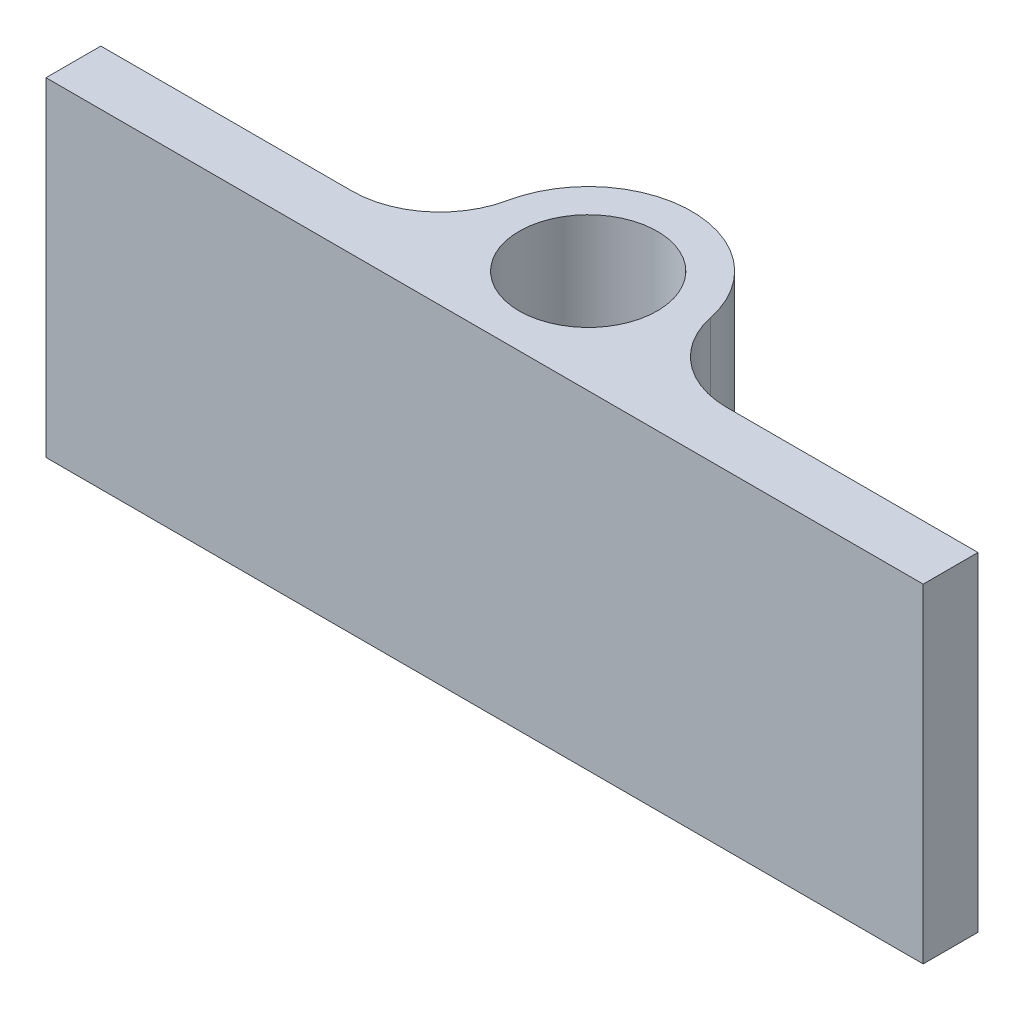
ISO-10303-21;
HEADER;
FILE_DESCRIPTION(('STEP AP214'),'2;1');
FILE_NAME('part.step','',(''),(''),'','','');
FILE_SCHEMA(('AUTOMOTIVE_DESIGN { 1 0 10303 214 1 1 1 1 }'));
ENDSEC;
DATA;
#1=APPLICATION_CONTEXT('core data for automotive mechanical design processes');
#2=APPLICATION_PROTOCOL_DEFINITION('international standard','automotive_design',2000,#1);
#3=PRODUCT_CONTEXT('',#1,'mechanical');
#4=PRODUCT('Part','Part','',(#3));
#5=PRODUCT_RELATED_PRODUCT_CATEGORY('part','',(#4));
#6=PRODUCT_DEFINITION_FORMATION('','',#4);
#7=PRODUCT_DEFINITION_CONTEXT('part definition',#1,'design');
#8=PRODUCT_DEFINITION('design','',#6,#7);
#9=PRODUCT_DEFINITION_SHAPE('','',#8);
#10=(LENGTH_UNIT() NAMED_UNIT(*) SI_UNIT(.MILLI.,.METRE.));
#11=(NAMED_UNIT(*) PLANE_ANGLE_UNIT() SI_UNIT($,.RADIAN.));
#12=(NAMED_UNIT(*) SI_UNIT($,.STERADIAN.) SOLID_ANGLE_UNIT());
#13=UNCERTAINTY_MEASURE_WITH_UNIT(LENGTH_MEASURE(1.E-05),#10,'distance_accuracy_value','');
#14=(GEOMETRIC_REPRESENTATION_CONTEXT(3) GLOBAL_UNCERTAINTY_ASSIGNED_CONTEXT((#13)) GLOBAL_UNIT_ASSIGNED_CONTEXT((#10,
#11,#12)) REPRESENTATION_CONTEXT('',''));
#15=CARTESIAN_POINT('',(0.,0.,0.));
#16=DIRECTION('',(0.,0.,1.));
#17=DIRECTION('',(1.,0.,0.));
#18=AXIS2_PLACEMENT_3D('',#15,#16,#17);
#19=CARTESIAN_POINT('',(0.,9.525,3.));
#20=DIRECTION('',(0.,0.,-1.));
#21=DIRECTION('',(-1.,0.,0.));
#22=AXIS2_PLACEMENT_3D('',#19,#20,#21);
#23=PLANE('',#22);
#24=DIRECTION('',(1.,0.,0.));
#25=VECTOR('',#24,1.);
#26=CARTESIAN_POINT('',(0.,0.,3.));
#27=LINE('',#26,#25);
#28=CARTESIAN_POINT('',(-12.7,0.,3.));
#29=VERTEX_POINT('',#28);
#30=CARTESIAN_POINT('',(12.7,0.,3.));
#31=VERTEX_POINT('',#30);
#32=EDGE_CURVE('E139',#29,#31,#27,.T.);
#33=ORIENTED_EDGE('',*,*,#32,.T.);
#34=DIRECTION('',(0.,-1.,0.));
#35=VECTOR('',#34,1.);
#36=CARTESIAN_POINT('',(12.7,9.525,3.));
#37=LINE('',#36,#35);
#38=CARTESIAN_POINT('',(12.7,9.525,3.));
#39=VERTEX_POINT('',#38);
#40=EDGE_CURVE('E119',#39,#31,#37,.T.);
#41=ORIENTED_EDGE('',*,*,#40,.F.);
#42=DIRECTION('',(1.,0.,0.));
#43=VECTOR('',#42,1.);
#44=CARTESIAN_POINT('',(0.,9.525,3.));
#45=LINE('',#44,#43);
#46=CARTESIAN_POINT('',(-12.7,9.525,3.));
#47=VERTEX_POINT('',#46);
#48=EDGE_CURVE('E126',#47,#39,#45,.T.);
#49=ORIENTED_EDGE('',*,*,#48,.F.);
#50=DIRECTION('',(0.,-1.,0.));
#51=VECTOR('',#50,1.);
#52=CARTESIAN_POINT('',(-12.7,9.525,3.));
#53=LINE('',#52,#51);
#54=EDGE_CURVE('E203',#47,#29,#53,.T.);
#55=ORIENTED_EDGE('',*,*,#54,.T.);
#56=EDGE_LOOP('',(#33,#41,#49,#55));
#57=FACE_BOUND('',#56,.T.);
#58=ADVANCED_FACE('F49',(#57),#23,.F.);
#59=CARTESIAN_POINT('',(12.7,9.525,0.));
#60=DIRECTION('',(-1.,0.,0.));
#61=DIRECTION('',(0.,0.,1.));
#62=AXIS2_PLACEMENT_3D('',#59,#60,#61);
#63=PLANE('',#62);
#64=DIRECTION('',(0.,0.,-1.));
#65=VECTOR('',#64,1.);
#66=CARTESIAN_POINT('',(12.7,0.,0.));
#67=LINE('',#66,#65);
#68=CARTESIAN_POINT('',(12.7,0.,1.4125));
#69=VERTEX_POINT('',#68);
#70=EDGE_CURVE('E197',#31,#69,#67,.T.);
#71=ORIENTED_EDGE('',*,*,#70,.T.);
#72=DIRECTION('',(0.,-1.,0.));
#73=VECTOR('',#72,1.);
#74=CARTESIAN_POINT('',(12.7,9.525,1.4125));
#75=LINE('',#74,#73);
#76=CARTESIAN_POINT('',(12.7,9.525,1.4125));
#77=VERTEX_POINT('',#76);
#78=EDGE_CURVE('E122',#77,#69,#75,.T.);
#79=ORIENTED_EDGE('',*,*,#78,.F.);
#80=DIRECTION('',(0.,0.,-1.));
#81=VECTOR('',#80,1.);
#82=CARTESIAN_POINT('',(12.7,9.525,0.));
#83=LINE('',#82,#81);
#84=EDGE_CURVE('E115',#39,#77,#83,.T.);
#85=ORIENTED_EDGE('',*,*,#84,.F.);
#86=ORIENTED_EDGE('',*,*,#40,.T.);
#87=EDGE_LOOP('',(#71,#79,#85,#86));
#88=FACE_BOUND('',#87,.T.);
#89=ADVANCED_FACE('F117',(#88),#63,.F.);
#90=CARTESIAN_POINT('',(0.,9.525,1.4125));
#91=DIRECTION('',(0.,0.,1.));
#92=DIRECTION('',(1.,0.,0.));
#93=AXIS2_PLACEMENT_3D('',#90,#91,#92);
#94=PLANE('',#93);
#95=DIRECTION('',(-1.,0.,0.));
#96=VECTOR('',#95,1.);
#97=CARTESIAN_POINT('',(0.,0.,1.4125));
#98=LINE('',#97,#96);
#99=CARTESIAN_POINT('',(5.42405233658378,0.,1.4125));
#100=VERTEX_POINT('',#99);
#101=EDGE_CURVE('E191',#69,#100,#98,.T.);
#102=ORIENTED_EDGE('',*,*,#101,.T.);
#103=DIRECTION('',(0.,1.,0.));
#104=VECTOR('',#103,1.);
#105=CARTESIAN_POINT('',(5.42405233658378,9.525,1.4125));
#106=LINE('',#105,#104);
#107=CARTESIAN_POINT('',(5.42405233658378,9.525,1.4125));
#108=VERTEX_POINT('',#107);
#109=EDGE_CURVE('E65',#100,#108,#106,.T.);
#110=ORIENTED_EDGE('',*,*,#109,.T.);
#111=DIRECTION('',(-1.,0.,0.));
#112=VECTOR('',#111,1.);
#113=CARTESIAN_POINT('',(0.,9.525,1.4125));
#114=LINE('',#113,#112);
#115=EDGE_CURVE('E125',#77,#108,#114,.T.);
#116=ORIENTED_EDGE('',*,*,#115,.F.);
#117=ORIENTED_EDGE('',*,*,#78,.T.);
#118=EDGE_LOOP('',(#102,#110,#116,#117));
#119=FACE_BOUND('',#118,.T.);
#120=ADVANCED_FACE('F245',(#119),#94,.F.);
#121=CARTESIAN_POINT('',(0.,9.525,0.));
#122=DIRECTION('',(0.,-1.,0.));
#123=DIRECTION('',(0.,0.,-1.));
#124=AXIS2_PLACEMENT_3D('',#121,#122,#123);
#125=CYLINDRICAL_SURFACE('',#124,3.);
#126=CARTESIAN_POINT('',(0.,0.,0.));
#127=DIRECTION('',(0.,1.,0.));
#128=DIRECTION('',(0.,0.,1.));
#129=AXIS2_PLACEMENT_3D('',#126,#127,#128);
#130=CIRCLE('',#129,3.);
#131=CARTESIAN_POINT('',(2.93721245663382,0.,-0.610559566787004));
#132=VERTEX_POINT('',#131);
#133=CARTESIAN_POINT('',(-2.93721245663382,0.,-0.610559566787004));
#134=VERTEX_POINT('',#133);
#135=EDGE_CURVE('E184',#132,#134,#130,.T.);
#136=ORIENTED_EDGE('',*,*,#135,.T.);
#137=DIRECTION('',(0.,-1.,0.));
#138=VECTOR('',#137,1.);
#139=CARTESIAN_POINT('',(-2.93721245663382,9.525,-0.610559566787004));
#140=LINE('',#139,#138);
#141=CARTESIAN_POINT('',(-2.93721245663382,9.525,-0.610559566787004));
#142=VERTEX_POINT('',#141);
#143=EDGE_CURVE('E155',#134,#142,#140,.F.);
#144=ORIENTED_EDGE('',*,*,#143,.T.);
#145=CARTESIAN_POINT('',(0.,9.525,0.));
#146=DIRECTION('',(0.,1.,0.));
#147=DIRECTION('',(0.,0.,1.));
#148=AXIS2_PLACEMENT_3D('',#145,#146,#147);
#149=CIRCLE('',#148,3.);
#150=CARTESIAN_POINT('',(2.93721245663382,9.525,-0.610559566787004));
#151=VERTEX_POINT('',#150);
#152=EDGE_CURVE('E171',#151,#142,#149,.T.);
#153=ORIENTED_EDGE('',*,*,#152,.F.);
#154=DIRECTION('',(0.,-1.,0.));
#155=VECTOR('',#154,1.);
#156=CARTESIAN_POINT('',(2.93721245663382,9.525,-0.610559566787004));
#157=LINE('',#156,#155);
#158=EDGE_CURVE('E146',#151,#132,#157,.T.);
#159=ORIENTED_EDGE('',*,*,#158,.T.);
#160=EDGE_LOOP('',(#136,#144,#153,#159));
#161=FACE_BOUND('',#160,.T.);
#162=ADVANCED_FACE('F188',(#161),#125,.T.);
#163=CARTESIAN_POINT('',(0.,9.525,1.4125));
#164=DIRECTION('',(0.,0.,-1.));
#165=DIRECTION('',(-1.,0.,0.));
#166=AXIS2_PLACEMENT_3D('',#163,#164,#165);
#167=PLANE('',#166);
#168=DIRECTION('',(1.,0.,0.));
#169=VECTOR('',#168,1.);
#170=CARTESIAN_POINT('',(0.,9.525,1.4125));
#171=LINE('',#170,#169);
#172=CARTESIAN_POINT('',(-12.7,9.525,1.4125));
#173=VERTEX_POINT('',#172);
#174=CARTESIAN_POINT('',(-5.42405233658378,9.525,1.4125));
#175=VERTEX_POINT('',#174);
#176=EDGE_CURVE('E169',#173,#175,#171,.T.);
#177=ORIENTED_EDGE('',*,*,#176,.T.);
#178=DIRECTION('',(0.,-1.,0.));
#179=VECTOR('',#178,1.);
#180=CARTESIAN_POINT('',(-5.42405233658378,9.525,1.4125));
#181=LINE('',#180,#179);
#182=CARTESIAN_POINT('',(-5.42405233658378,0.,1.4125));
#183=VERTEX_POINT('',#182);
#184=EDGE_CURVE('E141',#175,#183,#181,.T.);
#185=ORIENTED_EDGE('',*,*,#184,.T.);
#186=DIRECTION('',(1.,0.,0.));
#187=VECTOR('',#186,1.);
#188=CARTESIAN_POINT('',(0.,0.,1.4125));
#189=LINE('',#188,#187);
#190=CARTESIAN_POINT('',(-12.7,0.,1.4125));
#191=VERTEX_POINT('',#190);
#192=EDGE_CURVE('E186',#191,#183,#189,.T.);
#193=ORIENTED_EDGE('',*,*,#192,.F.);
#194=DIRECTION('',(0.,-1.,0.));
#195=VECTOR('',#194,1.);
#196=CARTESIAN_POINT('',(-12.7,9.525,1.4125));
#197=LINE('',#196,#195);
#198=EDGE_CURVE('E148',#173,#191,#197,.T.);
#199=ORIENTED_EDGE('',*,*,#198,.F.);
#200=EDGE_LOOP('',(#177,#185,#193,#199));
#201=FACE_BOUND('',#200,.T.);
#202=ADVANCED_FACE('F176',(#201),#167,.T.);
#203=CARTESIAN_POINT('',(0.,9.525,0.));
#204=DIRECTION('',(0.,-1.,0.));
#205=DIRECTION('',(0.,0.,-1.));
#206=AXIS2_PLACEMENT_3D('',#203,#204,#205);
#207=CYLINDRICAL_SURFACE('',#206,2.);
#208=CARTESIAN_POINT('',(0.,9.525,0.));
#209=DIRECTION('',(0.,1.,0.));
#210=DIRECTION('',(0.,0.,1.));
#211=AXIS2_PLACEMENT_3D('',#208,#209,#210);
#212=CIRCLE('',#211,2.);
#213=CARTESIAN_POINT('',(0.,9.525,2.));
#214=VERTEX_POINT('',#213);
#215=EDGE_CURVE('E136',#214,#214,#212,.T.);
#216=ORIENTED_EDGE('',*,*,#215,.T.);
#217=EDGE_LOOP('',(#216));
#218=FACE_BOUND('',#217,.T.);
#219=CARTESIAN_POINT('',(0.,0.,0.));
#220=DIRECTION('',(0.,1.,0.));
#221=DIRECTION('',(0.,0.,1.));
#222=AXIS2_PLACEMENT_3D('',#219,#220,#221);
#223=CIRCLE('',#222,2.);
#224=CARTESIAN_POINT('',(0.,0.,2.));
#225=VERTEX_POINT('',#224);
#226=EDGE_CURVE('E210',#225,#225,#223,.T.);
#227=ORIENTED_EDGE('',*,*,#226,.F.);
#228=EDGE_LOOP('',(#227));
#229=FACE_BOUND('',#228,.T.);
#230=ADVANCED_FACE('F227',(#218,#229),#207,.F.);
#231=CARTESIAN_POINT('',(-12.7,9.525,0.));
#232=DIRECTION('',(-1.,0.,0.));
#233=DIRECTION('',(0.,0.,1.));
#234=AXIS2_PLACEMENT_3D('',#231,#232,#233);
#235=PLANE('',#234);
#236=DIRECTION('',(0.,0.,-1.));
#237=VECTOR('',#236,1.);
#238=CARTESIAN_POINT('',(-12.7,0.,0.));
#239=LINE('',#238,#237);
#240=EDGE_CURVE('E195',#29,#191,#239,.T.);
#241=ORIENTED_EDGE('',*,*,#240,.F.);
#242=ORIENTED_EDGE('',*,*,#54,.F.);
#243=DIRECTION('',(0.,0.,-1.));
#244=VECTOR('',#243,1.);
#245=CARTESIAN_POINT('',(-12.7,9.525,0.));
#246=LINE('',#245,#244);
#247=EDGE_CURVE('E133',#47,#173,#246,.T.);
#248=ORIENTED_EDGE('',*,*,#247,.T.);
#249=ORIENTED_EDGE('',*,*,#198,.T.);
#250=EDGE_LOOP('',(#241,#242,#248,#249));
#251=FACE_BOUND('',#250,.T.);
#252=ADVANCED_FACE('F208',(#251),#235,.T.);
#253=CARTESIAN_POINT('',(0.,9.525,0.));
#254=DIRECTION('',(0.,1.,0.));
#255=DIRECTION('',(0.,0.,1.));
#256=AXIS2_PLACEMENT_3D('',#253,#254,#255);
#257=PLANE('',#256);
#258=ORIENTED_EDGE('',*,*,#215,.F.);
#259=EDGE_LOOP('',(#258));
#260=FACE_BOUND('',#259,.T.);
#261=ORIENTED_EDGE('',*,*,#48,.T.);
#262=ORIENTED_EDGE('',*,*,#84,.T.);
#263=ORIENTED_EDGE('',*,*,#115,.T.);
#264=CARTESIAN_POINT('',(5.42405233658378,9.525,-1.1275));
#265=DIRECTION('',(0.,1.,0.));
#266=DIRECTION('',(0.,0.,1.));
#267=AXIS2_PLACEMENT_3D('',#264,#265,#266);
#268=CIRCLE('',#267,2.54);
#269=EDGE_CURVE('E11',#108,#151,#268,.F.);
#270=ORIENTED_EDGE('',*,*,#269,.T.);
#271=ORIENTED_EDGE('',*,*,#152,.T.);
#272=CARTESIAN_POINT('',(-5.42405233658378,9.525,-1.1275));
#273=DIRECTION('',(0.,1.,0.));
#274=DIRECTION('',(0.,0.,1.));
#275=AXIS2_PLACEMENT_3D('',#272,#273,#274);
#276=CIRCLE('',#275,2.54);
#277=EDGE_CURVE('E163',#142,#175,#276,.F.);
#278=ORIENTED_EDGE('',*,*,#277,.T.);
#279=ORIENTED_EDGE('',*,*,#176,.F.);
#280=ORIENTED_EDGE('',*,*,#247,.F.);
#281=EDGE_LOOP('',(#261,#262,#263,#270,#271,#278,#279,#280));
#282=FACE_BOUND('',#281,.T.);
#283=ADVANCED_FACE('F130',(#260,#282),#257,.T.);
#284=CARTESIAN_POINT('',(0.,0.,0.));
#285=DIRECTION('',(0.,1.,0.));
#286=DIRECTION('',(0.,0.,1.));
#287=AXIS2_PLACEMENT_3D('',#284,#285,#286);
#288=PLANE('',#287);
#289=ORIENTED_EDGE('',*,*,#226,.T.);
#290=EDGE_LOOP('',(#289));
#291=FACE_BOUND('',#290,.T.);
#292=ORIENTED_EDGE('',*,*,#32,.F.);
#293=ORIENTED_EDGE('',*,*,#240,.T.);
#294=ORIENTED_EDGE('',*,*,#192,.T.);
#295=CARTESIAN_POINT('',(-5.42405233658378,0.,-1.1275));
#296=DIRECTION('',(0.,1.,0.));
#297=DIRECTION('',(0.,0.,1.));
#298=AXIS2_PLACEMENT_3D('',#295,#296,#297);
#299=CIRCLE('',#298,2.54);
#300=EDGE_CURVE('E160',#183,#134,#299,.T.);
#301=ORIENTED_EDGE('',*,*,#300,.T.);
#302=ORIENTED_EDGE('',*,*,#135,.F.);
#303=CARTESIAN_POINT('',(5.42405233658378,0.,-1.1275));
#304=DIRECTION('',(0.,1.,0.));
#305=DIRECTION('',(0.,0.,1.));
#306=AXIS2_PLACEMENT_3D('',#303,#304,#305);
#307=CIRCLE('',#306,2.54);
#308=EDGE_CURVE('E58',#132,#100,#307,.T.);
#309=ORIENTED_EDGE('',*,*,#308,.T.);
#310=ORIENTED_EDGE('',*,*,#101,.F.);
#311=ORIENTED_EDGE('',*,*,#70,.F.);
#312=EDGE_LOOP('',(#292,#293,#294,#301,#302,#309,#310,#311));
#313=FACE_BOUND('',#312,.T.);
#314=ADVANCED_FACE('F183',(#291,#313),#288,.F.);
#315=CARTESIAN_POINT('',(-5.42405233658378,9.525,-1.1275));
#316=DIRECTION('',(0.,-1.,0.));
#317=DIRECTION('',(0.,0.,-1.));
#318=AXIS2_PLACEMENT_3D('',#315,#316,#317);
#319=CYLINDRICAL_SURFACE('',#318,2.54);
#320=ORIENTED_EDGE('',*,*,#277,.F.);
#321=ORIENTED_EDGE('',*,*,#143,.F.);
#322=ORIENTED_EDGE('',*,*,#300,.F.);
#323=ORIENTED_EDGE('',*,*,#184,.F.);
#324=EDGE_LOOP('',(#320,#321,#322,#323));
#325=FACE_BOUND('',#324,.T.);
#326=ADVANCED_FACE('F181',(#325),#319,.F.);
#327=CARTESIAN_POINT('',(5.42405233658378,9.525,-1.1275));
#328=DIRECTION('',(0.,-1.,0.));
#329=DIRECTION('',(0.,0.,-1.));
#330=AXIS2_PLACEMENT_3D('',#327,#328,#329);
#331=CYLINDRICAL_SURFACE('',#330,2.54);
#332=ORIENTED_EDGE('',*,*,#269,.F.);
#333=ORIENTED_EDGE('',*,*,#109,.F.);
#334=ORIENTED_EDGE('',*,*,#308,.F.);
#335=ORIENTED_EDGE('',*,*,#158,.F.);
#336=EDGE_LOOP('',(#332,#333,#334,#335));
#337=FACE_BOUND('',#336,.T.);
#338=ADVANCED_FACE('F51',(#337),#331,.F.);
#339=CLOSED_SHELL('',(#58,#89,#120,#162,#202,#230,#252,#283,#314,#326,#338));
#340=MANIFOLD_SOLID_BREP('B2',#339);
#341=ADVANCED_BREP_SHAPE_REPRESENTATION('',(#18,#340),#14);
#342=SHAPE_DEFINITION_REPRESENTATION(#9,#341);
ENDSEC;
END-ISO-10303-21;
